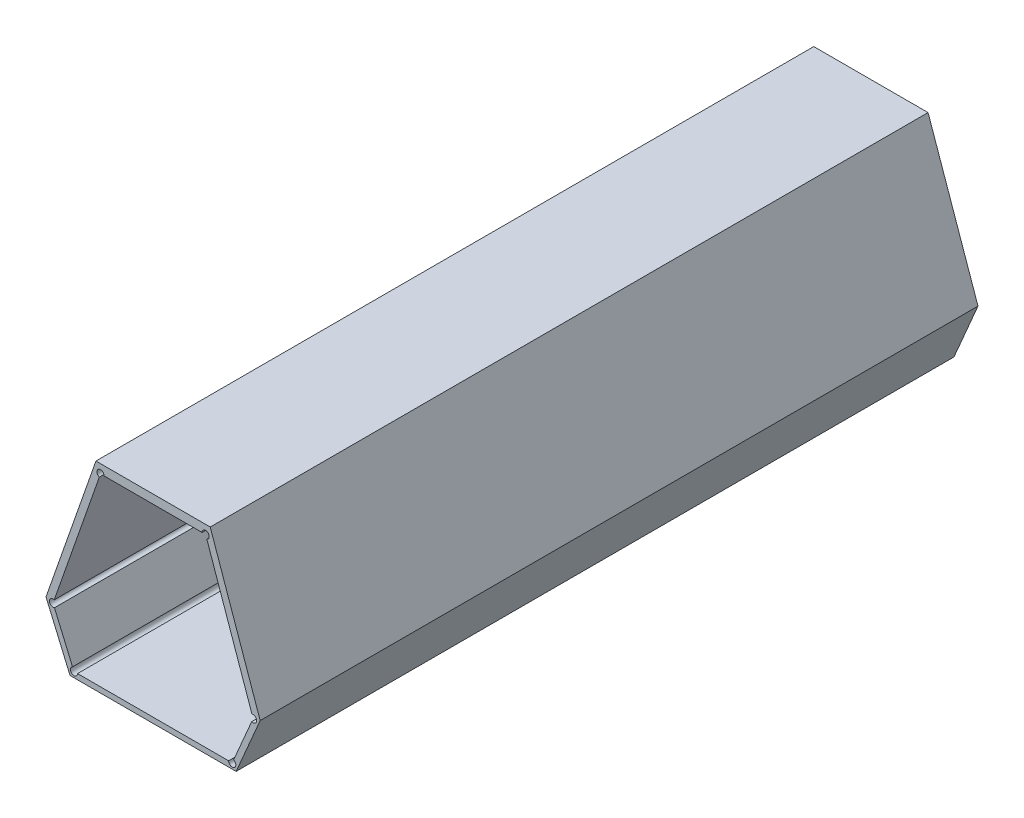
ISO-10303-21;
HEADER;
FILE_DESCRIPTION(('STEP AP214'),'2;1');
FILE_NAME('part.step','',(''),(''),'','','');
FILE_SCHEMA(('AUTOMOTIVE_DESIGN { 1 0 10303 214 1 1 1 1 }'));
ENDSEC;
DATA;
#1=APPLICATION_CONTEXT('core data for automotive mechanical design processes');
#2=APPLICATION_PROTOCOL_DEFINITION('international standard','automotive_design',2000,#1);
#3=PRODUCT_CONTEXT('',#1,'mechanical');
#4=PRODUCT('Part','Part','',(#3));
#5=PRODUCT_RELATED_PRODUCT_CATEGORY('part','',(#4));
#6=PRODUCT_DEFINITION_FORMATION('','',#4);
#7=PRODUCT_DEFINITION_CONTEXT('part definition',#1,'design');
#8=PRODUCT_DEFINITION('design','',#6,#7);
#9=PRODUCT_DEFINITION_SHAPE('','',#8);
#10=(LENGTH_UNIT() NAMED_UNIT(*) SI_UNIT(.MILLI.,.METRE.));
#11=(NAMED_UNIT(*) PLANE_ANGLE_UNIT() SI_UNIT($,.RADIAN.));
#12=(NAMED_UNIT(*) SI_UNIT($,.STERADIAN.) SOLID_ANGLE_UNIT());
#13=UNCERTAINTY_MEASURE_WITH_UNIT(LENGTH_MEASURE(1.E-05),#10,'distance_accuracy_value','');
#14=(GEOMETRIC_REPRESENTATION_CONTEXT(3) GLOBAL_UNCERTAINTY_ASSIGNED_CONTEXT((#13)) GLOBAL_UNIT_ASSIGNED_CONTEXT((#10,
#11,#12)) REPRESENTATION_CONTEXT('',''));
#15=CARTESIAN_POINT('',(0.,0.,0.));
#16=DIRECTION('',(0.,0.,1.));
#17=DIRECTION('',(1.,0.,0.));
#18=AXIS2_PLACEMENT_3D('',#15,#16,#17);
#19=CARTESIAN_POINT('',(-1.2831689286298,-0.405341919343764,0.1));
#20=DIRECTION('',(0.,0.,1.));
#21=DIRECTION('',(-1.,0.,0.));
#22=AXIS2_PLACEMENT_3D('',#19,#20,#21);
#23=CYLINDRICAL_SURFACE('',#22,0.0005);
#24=DIRECTION('',(0.,0.,1.));
#25=VECTOR('',#24,1.);
#26=CARTESIAN_POINT('',(-1.2829719731973,-0.404882345021584,0.1));
#27=LINE('',#26,#25);
#28=CARTESIAN_POINT('',(-1.2829719731973,-0.404882345021584,0.));
#29=VERTEX_POINT('',#28);
#30=CARTESIAN_POINT('',(-1.2829719731973,-0.404882345021584,0.1));
#31=VERTEX_POINT('',#30);
#32=EDGE_CURVE('E11',#29,#31,#27,.T.);
#33=ORIENTED_EDGE('',*,*,#32,.F.);
#34=CARTESIAN_POINT('',(-1.2831689286298,-0.405341919343764,0.));
#35=DIRECTION('',(0.,0.,1.));
#36=DIRECTION('',(-1.,0.,0.));
#37=AXIS2_PLACEMENT_3D('',#34,#35,#36);
#38=CIRCLE('',#37,0.0005);
#39=CARTESIAN_POINT('',(-1.2836689286298,-0.405341919343764,0.));
#40=VERTEX_POINT('',#39);
#41=EDGE_CURVE('E24',#40,#29,#38,.T.);
#42=ORIENTED_EDGE('',*,*,#41,.F.);
#43=DIRECTION('',(0.,0.,-1.));
#44=VECTOR('',#43,1.);
#45=CARTESIAN_POINT('',(-1.2836689286298,-0.405341919343764,0.1));
#46=LINE('',#45,#44);
#47=CARTESIAN_POINT('',(-1.2836689286298,-0.405341919343764,0.1));
#48=VERTEX_POINT('',#47);
#49=EDGE_CURVE('E282',#48,#40,#46,.T.);
#50=ORIENTED_EDGE('',*,*,#49,.F.);
#51=CARTESIAN_POINT('',(-1.2831689286298,-0.405341919343764,0.1));
#52=DIRECTION('',(0.,0.,-1.));
#53=DIRECTION('',(-1.,0.,0.));
#54=AXIS2_PLACEMENT_3D('',#51,#52,#53);
#55=CIRCLE('',#54,0.0005);
#56=EDGE_CURVE('E37',#31,#48,#55,.T.);
#57=ORIENTED_EDGE('',*,*,#56,.F.);
#58=EDGE_LOOP('',(#33,#42,#50,#57));
#59=FACE_BOUND('',#58,.T.);
#60=ADVANCED_FACE('F17',(#59),#23,.F.);
#61=CARTESIAN_POINT('',(-1.3081290486333,-0.398546889036204,0.1));
#62=DIRECTION('',(0.,0.,1.));
#63=DIRECTION('',(-1.,0.,0.));
#64=AXIS2_PLACEMENT_3D('',#61,#62,#63);
#65=CYLINDRICAL_SURFACE('',#64,0.0005);
#66=DIRECTION('',(0.,0.,-1.));
#67=VECTOR('',#66,1.);
#68=CARTESIAN_POINT('',(-1.3079638509052,-0.398074967739145,0.1));
#69=LINE('',#68,#67);
#70=CARTESIAN_POINT('',(-1.3079638509052,-0.398074967739145,0.1));
#71=VERTEX_POINT('',#70);
#72=CARTESIAN_POINT('',(-1.3079638509052,-0.398074967739145,0.));
#73=VERTEX_POINT('',#72);
#74=EDGE_CURVE('E278',#71,#73,#69,.T.);
#75=ORIENTED_EDGE('',*,*,#74,.F.);
#76=CARTESIAN_POINT('',(-1.3081290486333,-0.398546889036204,0.1));
#77=DIRECTION('',(0.,0.,-1.));
#78=DIRECTION('',(-1.,0.,0.));
#79=AXIS2_PLACEMENT_3D('',#76,#77,#78);
#80=CIRCLE('',#79,0.0005);
#81=CARTESIAN_POINT('',(-1.3079320932008,-0.399006463358383,0.1));
#82=VERTEX_POINT('',#81);
#83=EDGE_CURVE('E276',#82,#71,#80,.T.);
#84=ORIENTED_EDGE('',*,*,#83,.F.);
#85=DIRECTION('',(0.,0.,1.));
#86=VECTOR('',#85,1.);
#87=CARTESIAN_POINT('',(-1.3079320932008,-0.399006463358383,0.1));
#88=LINE('',#87,#86);
#89=CARTESIAN_POINT('',(-1.3079320932008,-0.399006463358383,0.));
#90=VERTEX_POINT('',#89);
#91=EDGE_CURVE('E274',#90,#82,#88,.T.);
#92=ORIENTED_EDGE('',*,*,#91,.F.);
#93=CARTESIAN_POINT('',(-1.3081290486333,-0.398546889036204,0.));
#94=DIRECTION('',(0.,0.,1.));
#95=DIRECTION('',(-1.,0.,0.));
#96=AXIS2_PLACEMENT_3D('',#93,#94,#95);
#97=CIRCLE('',#96,0.0005);
#98=EDGE_CURVE('E272',#73,#90,#97,.T.);
#99=ORIENTED_EDGE('',*,*,#98,.F.);
#100=EDGE_LOOP('',(#75,#84,#92,#99));
#101=FACE_BOUND('',#100,.T.);
#102=ADVANCED_FACE('F329',(#101),#65,.F.);
#103=CARTESIAN_POINT('',(-1.2868726607526,-0.379647454767227,0.1));
#104=DIRECTION('',(0.,0.,1.));
#105=DIRECTION('',(-1.,0.,0.));
#106=AXIS2_PLACEMENT_3D('',#103,#104,#105);
#107=CYLINDRICAL_SURFACE('',#106,0.0005);
#108=DIRECTION('',(0.,0.,1.));
#109=VECTOR('',#108,1.);
#110=CARTESIAN_POINT('',(-1.2873726607526,-0.379647454767227,0.1));
#111=LINE('',#110,#109);
#112=CARTESIAN_POINT('',(-1.2873726607526,-0.379647454767227,0.));
#113=VERTEX_POINT('',#112);
#114=CARTESIAN_POINT('',(-1.2873726607526,-0.379647454767227,0.1));
#115=VERTEX_POINT('',#114);
#116=EDGE_CURVE('E269',#113,#115,#111,.T.);
#117=ORIENTED_EDGE('',*,*,#116,.F.);
#118=CARTESIAN_POINT('',(-1.2868726607526,-0.379647454767227,0.));
#119=DIRECTION('',(0.,0.,1.));
#120=DIRECTION('',(-1.,0.,0.));
#121=AXIS2_PLACEMENT_3D('',#118,#119,#120);
#122=CIRCLE('',#121,0.0005);
#123=CARTESIAN_POINT('',(-1.2867074630244,-0.380119376064286,0.));
#124=VERTEX_POINT('',#123);
#125=EDGE_CURVE('E267',#124,#113,#122,.T.);
#126=ORIENTED_EDGE('',*,*,#125,.F.);
#127=DIRECTION('',(0.,0.,-1.));
#128=VECTOR('',#127,1.);
#129=CARTESIAN_POINT('',(-1.2867074630244,-0.380119376064286,0.1));
#130=LINE('',#129,#128);
#131=CARTESIAN_POINT('',(-1.2867074630244,-0.380119376064286,0.1));
#132=VERTEX_POINT('',#131);
#133=EDGE_CURVE('E265',#132,#124,#130,.T.);
#134=ORIENTED_EDGE('',*,*,#133,.F.);
#135=CARTESIAN_POINT('',(-1.2868726607526,-0.379647454767227,0.1));
#136=DIRECTION('',(0.,0.,-1.));
#137=DIRECTION('',(-1.,0.,0.));
#138=AXIS2_PLACEMENT_3D('',#135,#136,#137);
#139=CIRCLE('',#138,0.0005);
#140=EDGE_CURVE('E263',#115,#132,#139,.T.);
#141=ORIENTED_EDGE('',*,*,#140,.F.);
#142=EDGE_LOOP('',(#117,#126,#134,#141));
#143=FACE_BOUND('',#142,.T.);
#144=ADVANCED_FACE('F310',(#143),#107,.F.);
#145=CARTESIAN_POINT('',(-1.301513234463,-0.379647454767227,0.1));
#146=DIRECTION('',(0.,0.,1.));
#147=DIRECTION('',(-1.,0.,0.));
#148=AXIS2_PLACEMENT_3D('',#145,#146,#147);
#149=CYLINDRICAL_SURFACE('',#148,0.0005);
#150=DIRECTION('',(0.,0.,-1.));
#151=VECTOR('',#150,1.);
#152=CARTESIAN_POINT('',(-1.301013234463,-0.379647454767227,0.1));
#153=LINE('',#152,#151);
#154=CARTESIAN_POINT('',(-1.301013234463,-0.379647454767227,0.1));
#155=VERTEX_POINT('',#154);
#156=CARTESIAN_POINT('',(-1.301013234463,-0.379647454767227,0.));
#157=VERTEX_POINT('',#156);
#158=EDGE_CURVE('E260',#155,#157,#153,.T.);
#159=ORIENTED_EDGE('',*,*,#158,.F.);
#160=CARTESIAN_POINT('',(-1.301513234463,-0.379647454767227,0.1));
#161=DIRECTION('',(0.,0.,-1.));
#162=DIRECTION('',(-1.,0.,0.));
#163=AXIS2_PLACEMENT_3D('',#160,#161,#162);
#164=CIRCLE('',#163,0.0005);
#165=CARTESIAN_POINT('',(-1.3016784321912,-0.380119376064286,0.1));
#166=VERTEX_POINT('',#165);
#167=EDGE_CURVE('E258',#166,#155,#164,.T.);
#168=ORIENTED_EDGE('',*,*,#167,.F.);
#169=DIRECTION('',(0.,0.,1.));
#170=VECTOR('',#169,1.);
#171=CARTESIAN_POINT('',(-1.3016784321912,-0.380119376064286,0.1));
#172=LINE('',#171,#170);
#173=CARTESIAN_POINT('',(-1.3016784321912,-0.380119376064286,0.));
#174=VERTEX_POINT('',#173);
#175=EDGE_CURVE('E256',#174,#166,#172,.T.);
#176=ORIENTED_EDGE('',*,*,#175,.F.);
#177=CARTESIAN_POINT('',(-1.301513234463,-0.379647454767227,0.));
#178=DIRECTION('',(0.,0.,1.));
#179=DIRECTION('',(-1.,0.,0.));
#180=AXIS2_PLACEMENT_3D('',#177,#178,#179);
#181=CIRCLE('',#180,0.0005);
#182=EDGE_CURVE('E254',#157,#174,#181,.T.);
#183=ORIENTED_EDGE('',*,*,#182,.F.);
#184=EDGE_LOOP('',(#159,#168,#176,#183));
#185=FACE_BOUND('',#184,.T.);
#186=ADVANCED_FACE('F320',(#185),#149,.F.);
#187=CARTESIAN_POINT('',(-1.3052169665858,-0.405341919343764,0.1));
#188=DIRECTION('',(0.,0.,1.));
#189=DIRECTION('',(-1.,0.,0.));
#190=AXIS2_PLACEMENT_3D('',#187,#188,#189);
#191=CYLINDRICAL_SURFACE('',#190,0.0005);
#192=DIRECTION('',(0.,0.,1.));
#193=VECTOR('',#192,1.);
#194=CARTESIAN_POINT('',(-1.3047169665858,-0.405341919343764,0.1));
#195=LINE('',#194,#193);
#196=CARTESIAN_POINT('',(-1.3047169665858,-0.405341919343764,0.));
#197=VERTEX_POINT('',#196);
#198=CARTESIAN_POINT('',(-1.3047169665858,-0.405341919343764,0.1));
#199=VERTEX_POINT('',#198);
#200=EDGE_CURVE('E251',#197,#199,#195,.T.);
#201=ORIENTED_EDGE('',*,*,#200,.F.);
#202=CARTESIAN_POINT('',(-1.3052169665858,-0.405341919343764,0.));
#203=DIRECTION('',(0.,0.,1.));
#204=DIRECTION('',(-1.,0.,0.));
#205=AXIS2_PLACEMENT_3D('',#202,#203,#204);
#206=CIRCLE('',#205,0.0005);
#207=CARTESIAN_POINT('',(-1.3054139220183,-0.404882345021584,0.));
#208=VERTEX_POINT('',#207);
#209=EDGE_CURVE('E249',#208,#197,#206,.T.);
#210=ORIENTED_EDGE('',*,*,#209,.F.);
#211=DIRECTION('',(0.,0.,-1.));
#212=VECTOR('',#211,1.);
#213=CARTESIAN_POINT('',(-1.3054139220183,-0.404882345021584,0.1));
#214=LINE('',#213,#212);
#215=CARTESIAN_POINT('',(-1.3054139220183,-0.404882345021584,0.1));
#216=VERTEX_POINT('',#215);
#217=EDGE_CURVE('E247',#216,#208,#214,.T.);
#218=ORIENTED_EDGE('',*,*,#217,.F.);
#219=CARTESIAN_POINT('',(-1.3052169665858,-0.405341919343764,0.1));
#220=DIRECTION('',(0.,0.,-1.));
#221=DIRECTION('',(-1.,0.,0.));
#222=AXIS2_PLACEMENT_3D('',#219,#220,#221);
#223=CIRCLE('',#222,0.0005);
#224=EDGE_CURVE('E245',#199,#216,#223,.T.);
#225=ORIENTED_EDGE('',*,*,#224,.F.);
#226=EDGE_LOOP('',(#201,#210,#218,#225));
#227=FACE_BOUND('',#226,.T.);
#228=ADVANCED_FACE('F292',(#227),#191,.F.);
#229=CARTESIAN_POINT('',(-1.2802568465823,-0.398546889036204,0.1));
#230=DIRECTION('',(0.,0.,1.));
#231=DIRECTION('',(-1.,0.,0.));
#232=AXIS2_PLACEMENT_3D('',#229,#230,#231);
#233=CYLINDRICAL_SURFACE('',#232,0.0005);
#234=DIRECTION('',(0.,0.,1.));
#235=VECTOR('',#234,1.);
#236=CARTESIAN_POINT('',(-1.2804220443104,-0.398074967739145,0.1));
#237=LINE('',#236,#235);
#238=CARTESIAN_POINT('',(-1.2804220443104,-0.398074967739145,0.));
#239=VERTEX_POINT('',#238);
#240=CARTESIAN_POINT('',(-1.2804220443104,-0.398074967739145,0.1));
#241=VERTEX_POINT('',#240);
#242=EDGE_CURVE('E242',#239,#241,#237,.T.);
#243=ORIENTED_EDGE('',*,*,#242,.F.);
#244=CARTESIAN_POINT('',(-1.2802568465823,-0.398546889036204,0.));
#245=DIRECTION('',(0.,0.,1.));
#246=DIRECTION('',(-1.,0.,0.));
#247=AXIS2_PLACEMENT_3D('',#244,#245,#246);
#248=CIRCLE('',#247,0.0005);
#249=CARTESIAN_POINT('',(-1.2804538020148,-0.399006463358383,0.));
#250=VERTEX_POINT('',#249);
#251=EDGE_CURVE('E240',#250,#239,#248,.T.);
#252=ORIENTED_EDGE('',*,*,#251,.F.);
#253=DIRECTION('',(0.,0.,-1.));
#254=VECTOR('',#253,1.);
#255=CARTESIAN_POINT('',(-1.2804538020148,-0.399006463358383,0.1));
#256=LINE('',#255,#254);
#257=CARTESIAN_POINT('',(-1.2804538020148,-0.399006463358383,0.1));
#258=VERTEX_POINT('',#257);
#259=EDGE_CURVE('E238',#258,#250,#256,.T.);
#260=ORIENTED_EDGE('',*,*,#259,.F.);
#261=CARTESIAN_POINT('',(-1.2802568465823,-0.398546889036204,0.1));
#262=DIRECTION('',(0.,0.,-1.));
#263=DIRECTION('',(-1.,0.,0.));
#264=AXIS2_PLACEMENT_3D('',#261,#262,#263);
#265=CIRCLE('',#264,0.0005);
#266=EDGE_CURVE('E236',#241,#258,#265,.T.);
#267=ORIENTED_EDGE('',*,*,#266,.F.);
#268=EDGE_LOOP('',(#243,#252,#260,#267));
#269=FACE_BOUND('',#268,.T.);
#270=ADVANCED_FACE('F302',(#269),#233,.F.);
#271=CARTESIAN_POINT('',(-1.3081290486333,-0.398546889036204,0.));
#272=DIRECTION('',(-0.919148644359513,-0.393910865008913,0.));
#273=DIRECTION('',(0.393910865008913,-0.919148644359513,0.));
#274=AXIS2_PLACEMENT_3D('',#271,#272,#273);
#275=PLANE('',#274);
#276=ORIENTED_EDGE('',*,*,#91,.T.);
#277=DIRECTION('',(0.393910865008913,-0.919148644359513,0.));
#278=VECTOR('',#277,1.);
#279=CARTESIAN_POINT('',(-1.3081290486333,-0.398546889036204,0.1));
#280=LINE('',#279,#278);
#281=EDGE_CURVE('E233',#82,#216,#280,.T.);
#282=ORIENTED_EDGE('',*,*,#281,.T.);
#283=ORIENTED_EDGE('',*,*,#217,.T.);
#284=DIRECTION('',(0.393910865008913,-0.919148644359513,0.));
#285=VECTOR('',#284,1.);
#286=CARTESIAN_POINT('',(-1.3081290486333,-0.398546889036204,0.));
#287=LINE('',#286,#285);
#288=EDGE_CURVE('E230',#90,#208,#287,.T.);
#289=ORIENTED_EDGE('',*,*,#288,.F.);
#290=EDGE_LOOP('',(#276,#282,#283,#289));
#291=FACE_BOUND('',#290,.T.);
#292=ADVANCED_FACE('F331',(#291),#275,.F.);
#293=CARTESIAN_POINT('',(-1.2831689286298,-0.405341919343764,0.));
#294=DIRECTION('',(0.,1.,0.));
#295=DIRECTION('',(-1.,0.,0.));
#296=AXIS2_PLACEMENT_3D('',#293,#294,#295);
#297=PLANE('',#296);
#298=ORIENTED_EDGE('',*,*,#49,.T.);
#299=DIRECTION('',(-1.,0.,0.));
#300=VECTOR('',#299,1.);
#301=CARTESIAN_POINT('',(-1.2831689286298,-0.405341919343764,0.));
#302=LINE('',#301,#300);
#303=EDGE_CURVE('E227',#40,#197,#302,.T.);
#304=ORIENTED_EDGE('',*,*,#303,.T.);
#305=ORIENTED_EDGE('',*,*,#200,.T.);
#306=DIRECTION('',(-1.,0.,0.));
#307=VECTOR('',#306,1.);
#308=CARTESIAN_POINT('',(-1.2831689286298,-0.405341919343764,0.1));
#309=LINE('',#308,#307);
#310=EDGE_CURVE('E224',#48,#199,#309,.T.);
#311=ORIENTED_EDGE('',*,*,#310,.F.);
#312=EDGE_LOOP('',(#298,#304,#305,#311));
#313=FACE_BOUND('',#312,.T.);
#314=ADVANCED_FACE('F285',(#313),#297,.T.);
#315=CARTESIAN_POINT('',(-1.2854701744481,-0.393358053140412,0.));
#316=DIRECTION('',(0.,0.,1.));
#317=DIRECTION('',(1.,0.,0.));
#318=AXIS2_PLACEMENT_3D('',#315,#316,#317);
#319=PLANE('',#318);
#320=DIRECTION('',(-1.,0.,0.));
#321=VECTOR('',#320,1.);
#322=CARTESIAN_POINT('',(-1.2862320834894,-0.378418826466918,0.));
#323=LINE('',#322,#321);
#324=CARTESIAN_POINT('',(-1.2862320834894,-0.378418826466918,0.));
#325=VERTEX_POINT('',#324);
#326=CARTESIAN_POINT('',(-1.3021538117262,-0.378418826466918,0.));
#327=VERTEX_POINT('',#326);
#328=EDGE_CURVE('E222',#325,#327,#323,.T.);
#329=ORIENTED_EDGE('',*,*,#328,.F.);
#330=DIRECTION('',(-0.33039545627719,0.943842594117996,0.));
#331=VECTOR('',#330,1.);
#332=CARTESIAN_POINT('',(-1.27927535187,-0.398292161567361,0.));
#333=LINE('',#332,#331);
#334=CARTESIAN_POINT('',(-1.27927535187,-0.398292161567361,0.));
#335=VERTEX_POINT('',#334);
#336=EDGE_CURVE('E219',#335,#325,#333,.T.);
#337=ORIENTED_EDGE('',*,*,#336,.F.);
#338=DIRECTION('',(0.393910865008978,0.919148644359485,0.));
#339=VECTOR('',#338,1.);
#340=CARTESIAN_POINT('',(-1.2826223870961,-0.406102108344666,0.));
#341=LINE('',#340,#339);
#342=CARTESIAN_POINT('',(-1.2826223870961,-0.406102108344666,0.));
#343=VERTEX_POINT('',#342);
#344=EDGE_CURVE('E217',#343,#335,#341,.T.);
#345=ORIENTED_EDGE('',*,*,#344,.F.);
#346=DIRECTION('',(-1.,0.,0.));
#347=VECTOR('',#346,1.);
#348=CARTESIAN_POINT('',(-1.2941929476078,-0.406102108344666,0.));
#349=LINE('',#348,#347);
#350=CARTESIAN_POINT('',(-1.3057635081195,-0.406102108344666,0.));
#351=VERTEX_POINT('',#350);
#352=EDGE_CURVE('E159',#343,#351,#349,.T.);
#353=ORIENTED_EDGE('',*,*,#352,.T.);
#354=DIRECTION('',(-0.393910865008978,0.919148644359485,0.));
#355=VECTOR('',#354,1.);
#356=CARTESIAN_POINT('',(-1.3057635081195,-0.406102108344666,0.));
#357=LINE('',#356,#355);
#358=CARTESIAN_POINT('',(-1.3091105433457,-0.398292161567361,0.));
#359=VERTEX_POINT('',#358);
#360=EDGE_CURVE('E214',#351,#359,#357,.T.);
#361=ORIENTED_EDGE('',*,*,#360,.T.);
#362=DIRECTION('',(0.33039545627719,0.943842594117996,0.));
#363=VECTOR('',#362,1.);
#364=CARTESIAN_POINT('',(-1.3091105433457,-0.398292161567361,0.));
#365=LINE('',#364,#363);
#366=EDGE_CURVE('E211',#359,#327,#365,.T.);
#367=ORIENTED_EDGE('',*,*,#366,.T.);
#368=EDGE_LOOP('',(#329,#337,#345,#353,#361,#367));
#369=FACE_BOUND('',#368,.T.);
#370=ORIENTED_EDGE('',*,*,#41,.T.);
#371=DIRECTION('',(-0.393910865008913,-0.919148644359513,0.));
#372=VECTOR('',#371,1.);
#373=CARTESIAN_POINT('',(-1.2802568465823,-0.398546889036204,0.));
#374=LINE('',#373,#372);
#375=EDGE_CURVE('E208',#250,#29,#374,.T.);
#376=ORIENTED_EDGE('',*,*,#375,.F.);
#377=ORIENTED_EDGE('',*,*,#251,.T.);
#378=DIRECTION('',(0.330395456277153,-0.943842594118009,0.));
#379=VECTOR('',#378,1.);
#380=CARTESIAN_POINT('',(-1.2868726607526,-0.379647454767227,0.));
#381=LINE('',#380,#379);
#382=EDGE_CURVE('E205',#124,#239,#381,.T.);
#383=ORIENTED_EDGE('',*,*,#382,.F.);
#384=ORIENTED_EDGE('',*,*,#125,.T.);
#385=DIRECTION('',(1.,0.,0.));
#386=VECTOR('',#385,1.);
#387=CARTESIAN_POINT('',(-1.2941929476078,-0.379647454767227,0.));
#388=LINE('',#387,#386);
#389=EDGE_CURVE('E202',#157,#113,#388,.T.);
#390=ORIENTED_EDGE('',*,*,#389,.F.);
#391=ORIENTED_EDGE('',*,*,#182,.T.);
#392=DIRECTION('',(-0.330395456277153,-0.943842594118009,0.));
#393=VECTOR('',#392,1.);
#394=CARTESIAN_POINT('',(-1.301513234463,-0.379647454767227,0.));
#395=LINE('',#394,#393);
#396=EDGE_CURVE('E199',#174,#73,#395,.T.);
#397=ORIENTED_EDGE('',*,*,#396,.T.);
#398=ORIENTED_EDGE('',*,*,#98,.T.);
#399=ORIENTED_EDGE('',*,*,#288,.T.);
#400=ORIENTED_EDGE('',*,*,#209,.T.);
#401=ORIENTED_EDGE('',*,*,#303,.F.);
#402=EDGE_LOOP('',(#370,#376,#377,#383,#384,#390,#391,#397,#398,#399,#400,#401));
#403=FACE_BOUND('',#402,.T.);
#404=ADVANCED_FACE('F286',(#369,#403),#319,.F.);
#405=CARTESIAN_POINT('',(-1.2868726607526,-0.379647454767227,0.));
#406=DIRECTION('',(-0.943842594118009,-0.330395456277153,0.));
#407=DIRECTION('',(0.330395456277153,-0.943842594118009,0.));
#408=AXIS2_PLACEMENT_3D('',#405,#406,#407);
#409=PLANE('',#408);
#410=ORIENTED_EDGE('',*,*,#133,.T.);
#411=ORIENTED_EDGE('',*,*,#382,.T.);
#412=ORIENTED_EDGE('',*,*,#242,.T.);
#413=DIRECTION('',(0.330395456277153,-0.943842594118009,0.));
#414=VECTOR('',#413,1.);
#415=CARTESIAN_POINT('',(-1.2868726607526,-0.379647454767227,0.1));
#416=LINE('',#415,#414);
#417=EDGE_CURVE('E196',#132,#241,#416,.T.);
#418=ORIENTED_EDGE('',*,*,#417,.F.);
#419=EDGE_LOOP('',(#410,#411,#412,#418));
#420=FACE_BOUND('',#419,.T.);
#421=ADVANCED_FACE('F305',(#420),#409,.T.);
#422=CARTESIAN_POINT('',(-1.3091105433457,-0.398292161567361,0.));
#423=DIRECTION('',(0.943842594117996,-0.33039545627719,0.));
#424=DIRECTION('',(0.33039545627719,0.943842594117996,0.));
#425=AXIS2_PLACEMENT_3D('',#422,#423,#424);
#426=PLANE('',#425);
#427=ORIENTED_EDGE('',*,*,#366,.F.);
#428=DIRECTION('',(0.,0.,1.));
#429=VECTOR('',#428,1.);
#430=CARTESIAN_POINT('',(-1.3091105433457,-0.398292161567361,0.));
#431=LINE('',#430,#429);
#432=CARTESIAN_POINT('',(-1.3091105433457,-0.398292161567361,0.1));
#433=VERTEX_POINT('',#432);
#434=EDGE_CURVE('E194',#359,#433,#431,.T.);
#435=ORIENTED_EDGE('',*,*,#434,.T.);
#436=DIRECTION('',(0.33039545627719,0.943842594117996,0.));
#437=VECTOR('',#436,1.);
#438=CARTESIAN_POINT('',(-1.3091105433457,-0.398292161567361,0.1));
#439=LINE('',#438,#437);
#440=CARTESIAN_POINT('',(-1.3021538117262,-0.378418826466918,0.1));
#441=VERTEX_POINT('',#440);
#442=EDGE_CURVE('E192',#433,#441,#439,.T.);
#443=ORIENTED_EDGE('',*,*,#442,.T.);
#444=DIRECTION('',(0.,0.,1.));
#445=VECTOR('',#444,1.);
#446=CARTESIAN_POINT('',(-1.3021538117262,-0.378418826466918,0.));
#447=LINE('',#446,#445);
#448=EDGE_CURVE('E189',#327,#441,#447,.T.);
#449=ORIENTED_EDGE('',*,*,#448,.F.);
#450=EDGE_LOOP('',(#427,#435,#443,#449));
#451=FACE_BOUND('',#450,.T.);
#452=ADVANCED_FACE('F397',(#451),#426,.F.);
#453=CARTESIAN_POINT('',(-1.3057635081195,-0.406102108344666,0.));
#454=DIRECTION('',(0.919148644359485,0.393910865008978,0.));
#455=DIRECTION('',(-0.393910865008978,0.919148644359485,0.));
#456=AXIS2_PLACEMENT_3D('',#453,#454,#455);
#457=PLANE('',#456);
#458=ORIENTED_EDGE('',*,*,#360,.F.);
#459=DIRECTION('',(0.,0.,1.));
#460=VECTOR('',#459,1.);
#461=CARTESIAN_POINT('',(-1.3057635081195,-0.406102108344666,0.));
#462=LINE('',#461,#460);
#463=CARTESIAN_POINT('',(-1.3057635081195,-0.406102108344666,0.1));
#464=VERTEX_POINT('',#463);
#465=EDGE_CURVE('E187',#351,#464,#462,.T.);
#466=ORIENTED_EDGE('',*,*,#465,.T.);
#467=DIRECTION('',(-0.393910865008978,0.919148644359485,0.));
#468=VECTOR('',#467,1.);
#469=CARTESIAN_POINT('',(-1.3057635081195,-0.406102108344666,0.1));
#470=LINE('',#469,#468);
#471=EDGE_CURVE('E167',#464,#433,#470,.T.);
#472=ORIENTED_EDGE('',*,*,#471,.T.);
#473=ORIENTED_EDGE('',*,*,#434,.F.);
#474=EDGE_LOOP('',(#458,#466,#472,#473));
#475=FACE_BOUND('',#474,.T.);
#476=ADVANCED_FACE('F406',(#475),#457,.F.);
#477=CARTESIAN_POINT('',(-1.301513234463,-0.379647454767227,0.));
#478=DIRECTION('',(-0.943842594118009,0.330395456277153,0.));
#479=DIRECTION('',(-0.330395456277153,-0.943842594118009,0.));
#480=AXIS2_PLACEMENT_3D('',#477,#478,#479);
#481=PLANE('',#480);
#482=ORIENTED_EDGE('',*,*,#74,.T.);
#483=ORIENTED_EDGE('',*,*,#396,.F.);
#484=ORIENTED_EDGE('',*,*,#175,.T.);
#485=DIRECTION('',(-0.330395456277153,-0.943842594118009,0.));
#486=VECTOR('',#485,1.);
#487=CARTESIAN_POINT('',(-1.301513234463,-0.379647454767227,0.1));
#488=LINE('',#487,#486);
#489=EDGE_CURVE('E183',#166,#71,#488,.T.);
#490=ORIENTED_EDGE('',*,*,#489,.T.);
#491=EDGE_LOOP('',(#482,#483,#484,#490));
#492=FACE_BOUND('',#491,.T.);
#493=ADVANCED_FACE('F324',(#492),#481,.F.);
#494=CARTESIAN_POINT('',(-1.2862320834894,-0.378418826466918,0.));
#495=DIRECTION('',(0.,1.,0.));
#496=DIRECTION('',(-1.,0.,0.));
#497=AXIS2_PLACEMENT_3D('',#494,#495,#496);
#498=PLANE('',#497);
#499=ORIENTED_EDGE('',*,*,#328,.T.);
#500=ORIENTED_EDGE('',*,*,#448,.T.);
#501=DIRECTION('',(-1.,0.,0.));
#502=VECTOR('',#501,1.);
#503=CARTESIAN_POINT('',(-1.2862320834894,-0.378418826466918,0.1));
#504=LINE('',#503,#502);
#505=CARTESIAN_POINT('',(-1.2862320834894,-0.378418826466918,0.1));
#506=VERTEX_POINT('',#505);
#507=EDGE_CURVE('E181',#506,#441,#504,.T.);
#508=ORIENTED_EDGE('',*,*,#507,.F.);
#509=DIRECTION('',(0.,0.,1.));
#510=VECTOR('',#509,1.);
#511=CARTESIAN_POINT('',(-1.2862320834894,-0.378418826466918,0.));
#512=LINE('',#511,#510);
#513=EDGE_CURVE('E178',#325,#506,#512,.T.);
#514=ORIENTED_EDGE('',*,*,#513,.F.);
#515=EDGE_LOOP('',(#499,#500,#508,#514));
#516=FACE_BOUND('',#515,.T.);
#517=ADVANCED_FACE('F425',(#516),#498,.T.);
#518=CARTESIAN_POINT('',(-1.27927535187,-0.398292161567361,0.));
#519=DIRECTION('',(0.943842594117996,0.33039545627719,0.));
#520=DIRECTION('',(-0.33039545627719,0.943842594117996,0.));
#521=AXIS2_PLACEMENT_3D('',#518,#519,#520);
#522=PLANE('',#521);
#523=ORIENTED_EDGE('',*,*,#336,.T.);
#524=ORIENTED_EDGE('',*,*,#513,.T.);
#525=DIRECTION('',(-0.33039545627719,0.943842594117996,0.));
#526=VECTOR('',#525,1.);
#527=CARTESIAN_POINT('',(-1.27927535187,-0.398292161567361,0.1));
#528=LINE('',#527,#526);
#529=CARTESIAN_POINT('',(-1.27927535187,-0.398292161567361,0.1));
#530=VERTEX_POINT('',#529);
#531=EDGE_CURVE('E176',#530,#506,#528,.T.);
#532=ORIENTED_EDGE('',*,*,#531,.F.);
#533=DIRECTION('',(0.,0.,1.));
#534=VECTOR('',#533,1.);
#535=CARTESIAN_POINT('',(-1.27927535187,-0.398292161567361,0.));
#536=LINE('',#535,#534);
#537=EDGE_CURVE('E148',#335,#530,#536,.T.);
#538=ORIENTED_EDGE('',*,*,#537,.F.);
#539=EDGE_LOOP('',(#523,#524,#532,#538));
#540=FACE_BOUND('',#539,.T.);
#541=ADVANCED_FACE('F434',(#540),#522,.T.);
#542=CARTESIAN_POINT('',(-1.2826223870961,-0.406102108344666,0.));
#543=DIRECTION('',(0.919148644359485,-0.393910865008978,0.));
#544=DIRECTION('',(0.393910865008978,0.919148644359485,0.));
#545=AXIS2_PLACEMENT_3D('',#542,#543,#544);
#546=PLANE('',#545);
#547=ORIENTED_EDGE('',*,*,#344,.T.);
#548=ORIENTED_EDGE('',*,*,#537,.T.);
#549=DIRECTION('',(0.393910865008978,0.919148644359485,0.));
#550=VECTOR('',#549,1.);
#551=CARTESIAN_POINT('',(-1.2826223870961,-0.406102108344666,0.1));
#552=LINE('',#551,#550);
#553=CARTESIAN_POINT('',(-1.2826223870961,-0.406102108344666,0.1));
#554=VERTEX_POINT('',#553);
#555=EDGE_CURVE('E142',#554,#530,#552,.T.);
#556=ORIENTED_EDGE('',*,*,#555,.F.);
#557=DIRECTION('',(0.,0.,1.));
#558=VECTOR('',#557,1.);
#559=CARTESIAN_POINT('',(-1.2826223870961,-0.406102108344666,0.));
#560=LINE('',#559,#558);
#561=EDGE_CURVE('E146',#343,#554,#560,.T.);
#562=ORIENTED_EDGE('',*,*,#561,.F.);
#563=EDGE_LOOP('',(#547,#548,#556,#562));
#564=FACE_BOUND('',#563,.T.);
#565=ADVANCED_FACE('F145',(#564),#546,.T.);
#566=CARTESIAN_POINT('',(-1.2941929476078,-0.406102108344666,0.));
#567=DIRECTION('',(0.,-1.,0.));
#568=DIRECTION('',(1.,0.,0.));
#569=AXIS2_PLACEMENT_3D('',#566,#567,#568);
#570=PLANE('',#569);
#571=ORIENTED_EDGE('',*,*,#352,.F.);
#572=ORIENTED_EDGE('',*,*,#561,.T.);
#573=DIRECTION('',(-1.,0.,0.));
#574=VECTOR('',#573,1.);
#575=CARTESIAN_POINT('',(-1.2941929476078,-0.406102108344666,0.1));
#576=LINE('',#575,#574);
#577=EDGE_CURVE('E158',#554,#464,#576,.T.);
#578=ORIENTED_EDGE('',*,*,#577,.T.);
#579=ORIENTED_EDGE('',*,*,#465,.F.);
#580=EDGE_LOOP('',(#571,#572,#578,#579));
#581=FACE_BOUND('',#580,.T.);
#582=ADVANCED_FACE('F156',(#581),#570,.T.);
#583=CARTESIAN_POINT('',(-1.2802568465823,-0.398546889036204,0.));
#584=DIRECTION('',(-0.919148644359513,0.393910865008913,0.));
#585=DIRECTION('',(-0.393910865008913,-0.919148644359513,0.));
#586=AXIS2_PLACEMENT_3D('',#583,#584,#585);
#587=PLANE('',#586);
#588=ORIENTED_EDGE('',*,*,#32,.T.);
#589=DIRECTION('',(-0.393910865008913,-0.919148644359513,0.));
#590=VECTOR('',#589,1.);
#591=CARTESIAN_POINT('',(-1.2802568465823,-0.398546889036204,0.1));
#592=LINE('',#591,#590);
#593=EDGE_CURVE('E168',#258,#31,#592,.T.);
#594=ORIENTED_EDGE('',*,*,#593,.F.);
#595=ORIENTED_EDGE('',*,*,#259,.T.);
#596=ORIENTED_EDGE('',*,*,#375,.T.);
#597=EDGE_LOOP('',(#588,#594,#595,#596));
#598=FACE_BOUND('',#597,.T.);
#599=ADVANCED_FACE('F297',(#598),#587,.T.);
#600=CARTESIAN_POINT('',(-1.2941929476078,-0.379647454767227,0.));
#601=DIRECTION('',(0.,-1.,0.));
#602=DIRECTION('',(1.,0.,0.));
#603=AXIS2_PLACEMENT_3D('',#600,#601,#602);
#604=PLANE('',#603);
#605=ORIENTED_EDGE('',*,*,#116,.T.);
#606=DIRECTION('',(-1.,0.,0.));
#607=VECTOR('',#606,1.);
#608=CARTESIAN_POINT('',(-1.2941929476078,-0.379647454767227,0.1));
#609=LINE('',#608,#607);
#610=EDGE_CURVE('E171',#115,#155,#609,.T.);
#611=ORIENTED_EDGE('',*,*,#610,.T.);
#612=ORIENTED_EDGE('',*,*,#158,.T.);
#613=ORIENTED_EDGE('',*,*,#389,.T.);
#614=EDGE_LOOP('',(#605,#611,#612,#613));
#615=FACE_BOUND('',#614,.T.);
#616=ADVANCED_FACE('F314',(#615),#604,.T.);
#617=CARTESIAN_POINT('',(-1.2854701744481,-0.393358053140412,0.1));
#618=DIRECTION('',(0.,0.,1.));
#619=DIRECTION('',(1.,0.,0.));
#620=AXIS2_PLACEMENT_3D('',#617,#618,#619);
#621=PLANE('',#620);
#622=ORIENTED_EDGE('',*,*,#507,.T.);
#623=ORIENTED_EDGE('',*,*,#442,.F.);
#624=ORIENTED_EDGE('',*,*,#471,.F.);
#625=ORIENTED_EDGE('',*,*,#577,.F.);
#626=ORIENTED_EDGE('',*,*,#555,.T.);
#627=ORIENTED_EDGE('',*,*,#531,.T.);
#628=EDGE_LOOP('',(#622,#623,#624,#625,#626,#627));
#629=FACE_BOUND('',#628,.T.);
#630=ORIENTED_EDGE('',*,*,#56,.T.);
#631=ORIENTED_EDGE('',*,*,#310,.T.);
#632=ORIENTED_EDGE('',*,*,#224,.T.);
#633=ORIENTED_EDGE('',*,*,#281,.F.);
#634=ORIENTED_EDGE('',*,*,#83,.T.);
#635=ORIENTED_EDGE('',*,*,#489,.F.);
#636=ORIENTED_EDGE('',*,*,#167,.T.);
#637=ORIENTED_EDGE('',*,*,#610,.F.);
#638=ORIENTED_EDGE('',*,*,#140,.T.);
#639=ORIENTED_EDGE('',*,*,#417,.T.);
#640=ORIENTED_EDGE('',*,*,#266,.T.);
#641=ORIENTED_EDGE('',*,*,#593,.T.);
#642=EDGE_LOOP('',(#630,#631,#632,#633,#634,#635,#636,#637,#638,#639,#640,#641));
#643=FACE_BOUND('',#642,.T.);
#644=ADVANCED_FACE('F163',(#629,#643),#621,.T.);
#645=CLOSED_SHELL('',(#60,#102,#144,#186,#228,#270,#292,#314,#404,#421,#452,#476,#493,#517,#541,
#565,#582,#599,#616,#644));
#646=MANIFOLD_SOLID_BREP('B1',#645);
#647=ADVANCED_BREP_SHAPE_REPRESENTATION('',(#18,#646),#14);
#648=SHAPE_DEFINITION_REPRESENTATION(#9,#647);
ENDSEC;
END-ISO-10303-21;
